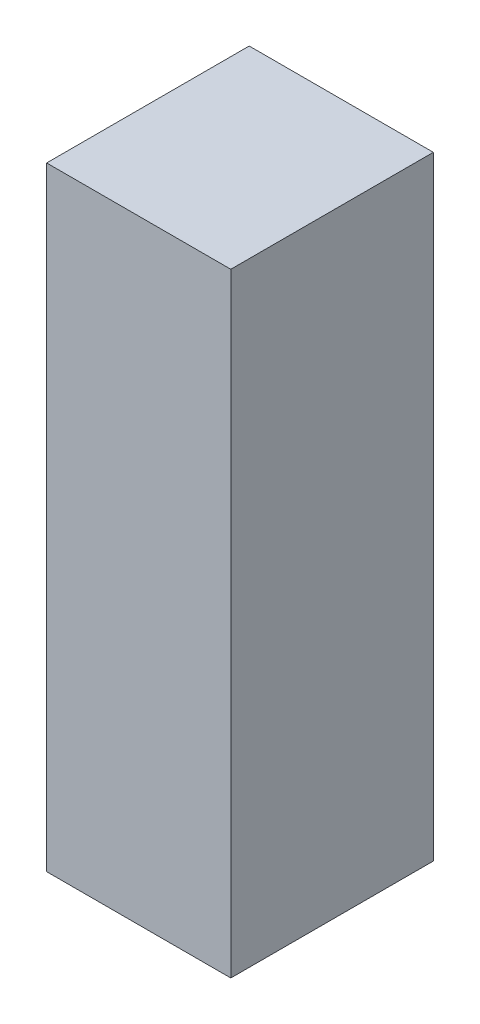
ISO-10303-21;
HEADER;
FILE_DESCRIPTION(('STEP AP214'),'2;1');
FILE_NAME('part.step','',(''),(''),'','','');
FILE_SCHEMA(('AUTOMOTIVE_DESIGN { 1 0 10303 214 1 1 1 1 }'));
ENDSEC;
DATA;
#1=APPLICATION_CONTEXT('core data for automotive mechanical design processes');
#2=APPLICATION_PROTOCOL_DEFINITION('international standard','automotive_design',2000,#1);
#3=PRODUCT_CONTEXT('',#1,'mechanical');
#4=PRODUCT('Part','Part','',(#3));
#5=PRODUCT_RELATED_PRODUCT_CATEGORY('part','',(#4));
#6=PRODUCT_DEFINITION_FORMATION('','',#4);
#7=PRODUCT_DEFINITION_CONTEXT('part definition',#1,'design');
#8=PRODUCT_DEFINITION('design','',#6,#7);
#9=PRODUCT_DEFINITION_SHAPE('','',#8);
#10=(LENGTH_UNIT() NAMED_UNIT(*) SI_UNIT(.MILLI.,.METRE.));
#11=(NAMED_UNIT(*) PLANE_ANGLE_UNIT() SI_UNIT($,.RADIAN.));
#12=(NAMED_UNIT(*) SI_UNIT($,.STERADIAN.) SOLID_ANGLE_UNIT());
#13=UNCERTAINTY_MEASURE_WITH_UNIT(LENGTH_MEASURE(1.E-05),#10,'distance_accuracy_value','');
#14=(GEOMETRIC_REPRESENTATION_CONTEXT(3) GLOBAL_UNCERTAINTY_ASSIGNED_CONTEXT((#13)) GLOBAL_UNIT_ASSIGNED_CONTEXT((#10,
#11,#12)) REPRESENTATION_CONTEXT('',''));
#15=CARTESIAN_POINT('',(0.,0.,0.));
#16=DIRECTION('',(0.,0.,1.));
#17=DIRECTION('',(1.,0.,0.));
#18=AXIS2_PLACEMENT_3D('',#15,#16,#17);
#19=CARTESIAN_POINT('',(0.,0.,660.));
#20=DIRECTION('',(1.,0.,0.));
#21=DIRECTION('',(0.,0.,-1.));
#22=AXIS2_PLACEMENT_3D('',#19,#20,#21);
#23=PLANE('',#22);
#24=DIRECTION('',(0.,-1.,0.));
#25=VECTOR('',#24,1.);
#26=CARTESIAN_POINT('',(0.,0.,0.));
#27=LINE('',#26,#25);
#28=CARTESIAN_POINT('',(0.,2000.,0.));
#29=VERTEX_POINT('',#28);
#30=CARTESIAN_POINT('',(0.,0.,0.));
#31=VERTEX_POINT('',#30);
#32=EDGE_CURVE('E132',#29,#31,#27,.T.);
#33=ORIENTED_EDGE('',*,*,#32,.T.);
#34=DIRECTION('',(0.,0.,-1.));
#35=VECTOR('',#34,1.);
#36=CARTESIAN_POINT('',(0.,0.,660.));
#37=LINE('',#36,#35);
#38=CARTESIAN_POINT('',(0.,0.,660.));
#39=VERTEX_POINT('',#38);
#40=EDGE_CURVE('E11',#39,#31,#37,.T.);
#41=ORIENTED_EDGE('',*,*,#40,.F.);
#42=DIRECTION('',(0.,-1.,0.));
#43=VECTOR('',#42,1.);
#44=CARTESIAN_POINT('',(0.,0.,660.));
#45=LINE('',#44,#43);
#46=CARTESIAN_POINT('',(0.,2000.,660.));
#47=VERTEX_POINT('',#46);
#48=EDGE_CURVE('E142',#47,#39,#45,.T.);
#49=ORIENTED_EDGE('',*,*,#48,.F.);
#50=DIRECTION('',(0.,0.,-1.));
#51=VECTOR('',#50,1.);
#52=CARTESIAN_POINT('',(0.,2000.,660.));
#53=LINE('',#52,#51);
#54=EDGE_CURVE('E147',#47,#29,#53,.T.);
#55=ORIENTED_EDGE('',*,*,#54,.T.);
#56=EDGE_LOOP('',(#33,#41,#49,#55));
#57=FACE_BOUND('',#56,.T.);
#58=ADVANCED_FACE('F34',(#57),#23,.F.);
#59=CARTESIAN_POINT('',(0.,0.,660.));
#60=DIRECTION('',(0.,1.,0.));
#61=DIRECTION('',(0.,0.,1.));
#62=AXIS2_PLACEMENT_3D('',#59,#60,#61);
#63=PLANE('',#62);
#64=DIRECTION('',(1.,0.,0.));
#65=VECTOR('',#64,1.);
#66=CARTESIAN_POINT('',(0.,0.,0.));
#67=LINE('',#66,#65);
#68=CARTESIAN_POINT('',(600.,0.,0.));
#69=VERTEX_POINT('',#68);
#70=EDGE_CURVE('E136',#31,#69,#67,.T.);
#71=ORIENTED_EDGE('',*,*,#70,.T.);
#72=DIRECTION('',(0.,0.,-1.));
#73=VECTOR('',#72,1.);
#74=CARTESIAN_POINT('',(600.,0.,660.));
#75=LINE('',#74,#73);
#76=CARTESIAN_POINT('',(600.,0.,660.));
#77=VERTEX_POINT('',#76);
#78=EDGE_CURVE('E42',#77,#69,#75,.T.);
#79=ORIENTED_EDGE('',*,*,#78,.F.);
#80=DIRECTION('',(1.,0.,0.));
#81=VECTOR('',#80,1.);
#82=CARTESIAN_POINT('',(0.,0.,660.));
#83=LINE('',#82,#81);
#84=EDGE_CURVE('E81',#39,#77,#83,.T.);
#85=ORIENTED_EDGE('',*,*,#84,.F.);
#86=ORIENTED_EDGE('',*,*,#40,.T.);
#87=EDGE_LOOP('',(#71,#79,#85,#86));
#88=FACE_BOUND('',#87,.T.);
#89=ADVANCED_FACE('F171',(#88),#63,.F.);
#90=CARTESIAN_POINT('',(600.,0.,660.));
#91=DIRECTION('',(-1.,0.,0.));
#92=DIRECTION('',(0.,0.,1.));
#93=AXIS2_PLACEMENT_3D('',#90,#91,#92);
#94=PLANE('',#93);
#95=DIRECTION('',(0.,1.,0.));
#96=VECTOR('',#95,1.);
#97=CARTESIAN_POINT('',(600.,0.,0.));
#98=LINE('',#97,#96);
#99=CARTESIAN_POINT('',(600.,2000.,0.));
#100=VERTEX_POINT('',#99);
#101=EDGE_CURVE('E68',#69,#100,#98,.T.);
#102=ORIENTED_EDGE('',*,*,#101,.T.);
#103=DIRECTION('',(0.,0.,-1.));
#104=VECTOR('',#103,1.);
#105=CARTESIAN_POINT('',(600.,2000.,660.));
#106=LINE('',#105,#104);
#107=CARTESIAN_POINT('',(600.,2000.,660.));
#108=VERTEX_POINT('',#107);
#109=EDGE_CURVE('E153',#108,#100,#106,.T.);
#110=ORIENTED_EDGE('',*,*,#109,.F.);
#111=DIRECTION('',(0.,1.,0.));
#112=VECTOR('',#111,1.);
#113=CARTESIAN_POINT('',(600.,0.,660.));
#114=LINE('',#113,#112);
#115=EDGE_CURVE('E145',#77,#108,#114,.T.);
#116=ORIENTED_EDGE('',*,*,#115,.F.);
#117=ORIENTED_EDGE('',*,*,#78,.T.);
#118=EDGE_LOOP('',(#102,#110,#116,#117));
#119=FACE_BOUND('',#118,.T.);
#120=ADVANCED_FACE('F155',(#119),#94,.F.);
#121=CARTESIAN_POINT('',(0.,2000.,660.));
#122=DIRECTION('',(0.,-1.,0.));
#123=DIRECTION('',(0.,0.,-1.));
#124=AXIS2_PLACEMENT_3D('',#121,#122,#123);
#125=PLANE('',#124);
#126=DIRECTION('',(-1.,0.,0.));
#127=VECTOR('',#126,1.);
#128=CARTESIAN_POINT('',(0.,2000.,0.));
#129=LINE('',#128,#127);
#130=EDGE_CURVE('E74',#100,#29,#129,.T.);
#131=ORIENTED_EDGE('',*,*,#130,.T.);
#132=ORIENTED_EDGE('',*,*,#54,.F.);
#133=DIRECTION('',(-1.,0.,0.));
#134=VECTOR('',#133,1.);
#135=CARTESIAN_POINT('',(0.,2000.,660.));
#136=LINE('',#135,#134);
#137=EDGE_CURVE('E50',#108,#47,#136,.T.);
#138=ORIENTED_EDGE('',*,*,#137,.F.);
#139=ORIENTED_EDGE('',*,*,#109,.T.);
#140=EDGE_LOOP('',(#131,#132,#138,#139));
#141=FACE_BOUND('',#140,.T.);
#142=ADVANCED_FACE('F162',(#141),#125,.F.);
#143=CARTESIAN_POINT('',(0.,0.,660.));
#144=DIRECTION('',(0.,0.,1.));
#145=DIRECTION('',(1.,0.,0.));
#146=AXIS2_PLACEMENT_3D('',#143,#144,#145);
#147=PLANE('',#146);
#148=ORIENTED_EDGE('',*,*,#48,.T.);
#149=ORIENTED_EDGE('',*,*,#84,.T.);
#150=ORIENTED_EDGE('',*,*,#115,.T.);
#151=ORIENTED_EDGE('',*,*,#137,.T.);
#152=EDGE_LOOP('',(#148,#149,#150,#151));
#153=FACE_BOUND('',#152,.T.);
#154=ADVANCED_FACE('F164',(#153),#147,.T.);
#155=CARTESIAN_POINT('',(0.,0.,0.));
#156=DIRECTION('',(0.,0.,1.));
#157=DIRECTION('',(1.,0.,0.));
#158=AXIS2_PLACEMENT_3D('',#155,#156,#157);
#159=PLANE('',#158);
#160=ORIENTED_EDGE('',*,*,#32,.F.);
#161=ORIENTED_EDGE('',*,*,#130,.F.);
#162=ORIENTED_EDGE('',*,*,#101,.F.);
#163=ORIENTED_EDGE('',*,*,#70,.F.);
#164=EDGE_LOOP('',(#160,#161,#162,#163));
#165=FACE_BOUND('',#164,.T.);
#166=ADVANCED_FACE('F158',(#165),#159,.F.);
#167=CLOSED_SHELL('',(#58,#89,#120,#142,#154,#166));
#168=CARTESIAN_POINT('',(20.,0.,640.));
#169=DIRECTION('',(1.,0.,0.));
#170=DIRECTION('',(0.,0.,-1.));
#171=AXIS2_PLACEMENT_3D('',#168,#169,#170);
#172=PLANE('',#171);
#173=DIRECTION('',(0.,-1.,0.));
#174=VECTOR('',#173,1.);
#175=CARTESIAN_POINT('',(20.,0.,20.));
#176=LINE('',#175,#174);
#177=CARTESIAN_POINT('',(20.,1980.,20.));
#178=VERTEX_POINT('',#177);
#179=CARTESIAN_POINT('',(20.,20.,20.));
#180=VERTEX_POINT('',#179);
#181=EDGE_CURVE('E261',#178,#180,#176,.T.);
#182=ORIENTED_EDGE('',*,*,#181,.F.);
#183=DIRECTION('',(0.,0.,-1.));
#184=VECTOR('',#183,1.);
#185=CARTESIAN_POINT('',(20.,1980.,640.));
#186=LINE('',#185,#184);
#187=CARTESIAN_POINT('',(20.,1980.,640.));
#188=VERTEX_POINT('',#187);
#189=EDGE_CURVE('E127',#188,#178,#186,.T.);
#190=ORIENTED_EDGE('',*,*,#189,.F.);
#191=DIRECTION('',(0.,-1.,0.));
#192=VECTOR('',#191,1.);
#193=CARTESIAN_POINT('',(20.,0.,640.));
#194=LINE('',#193,#192);
#195=CARTESIAN_POINT('',(20.,20.,640.));
#196=VERTEX_POINT('',#195);
#197=EDGE_CURVE('E112',#188,#196,#194,.T.);
#198=ORIENTED_EDGE('',*,*,#197,.T.);
#199=DIRECTION('',(0.,0.,-1.));
#200=VECTOR('',#199,1.);
#201=CARTESIAN_POINT('',(20.,20.,640.));
#202=LINE('',#201,#200);
#203=EDGE_CURVE('E124',#196,#180,#202,.T.);
#204=ORIENTED_EDGE('',*,*,#203,.T.);
#205=EDGE_LOOP('',(#182,#190,#198,#204));
#206=FACE_BOUND('',#205,.T.);
#207=ADVANCED_FACE('F123',(#206),#172,.T.);
#208=CARTESIAN_POINT('',(0.,20.,640.));
#209=DIRECTION('',(0.,1.,0.));
#210=DIRECTION('',(0.,0.,1.));
#211=AXIS2_PLACEMENT_3D('',#208,#209,#210);
#212=PLANE('',#211);
#213=DIRECTION('',(1.,0.,0.));
#214=VECTOR('',#213,1.);
#215=CARTESIAN_POINT('',(0.,20.,20.));
#216=LINE('',#215,#214);
#217=CARTESIAN_POINT('',(580.,20.,20.));
#218=VERTEX_POINT('',#217);
#219=EDGE_CURVE('E131',#180,#218,#216,.T.);
#220=ORIENTED_EDGE('',*,*,#219,.F.);
#221=ORIENTED_EDGE('',*,*,#203,.F.);
#222=DIRECTION('',(1.,0.,0.));
#223=VECTOR('',#222,1.);
#224=CARTESIAN_POINT('',(0.,20.,640.));
#225=LINE('',#224,#223);
#226=CARTESIAN_POINT('',(580.,20.,640.));
#227=VERTEX_POINT('',#226);
#228=EDGE_CURVE('E108',#196,#227,#225,.T.);
#229=ORIENTED_EDGE('',*,*,#228,.T.);
#230=DIRECTION('',(0.,0.,-1.));
#231=VECTOR('',#230,1.);
#232=CARTESIAN_POINT('',(580.,20.,640.));
#233=LINE('',#232,#231);
#234=EDGE_CURVE('E133',#227,#218,#233,.T.);
#235=ORIENTED_EDGE('',*,*,#234,.T.);
#236=EDGE_LOOP('',(#220,#221,#229,#235));
#237=FACE_BOUND('',#236,.T.);
#238=ADVANCED_FACE('F130',(#237),#212,.T.);
#239=CARTESIAN_POINT('',(580.,0.,640.));
#240=DIRECTION('',(-1.,0.,0.));
#241=DIRECTION('',(0.,0.,1.));
#242=AXIS2_PLACEMENT_3D('',#239,#240,#241);
#243=PLANE('',#242);
#244=DIRECTION('',(0.,1.,0.));
#245=VECTOR('',#244,1.);
#246=CARTESIAN_POINT('',(580.,0.,20.));
#247=LINE('',#246,#245);
#248=CARTESIAN_POINT('',(580.,1980.,20.));
#249=VERTEX_POINT('',#248);
#250=EDGE_CURVE('E264',#218,#249,#247,.T.);
#251=ORIENTED_EDGE('',*,*,#250,.F.);
#252=ORIENTED_EDGE('',*,*,#234,.F.);
#253=DIRECTION('',(0.,1.,0.));
#254=VECTOR('',#253,1.);
#255=CARTESIAN_POINT('',(580.,0.,640.));
#256=LINE('',#255,#254);
#257=CARTESIAN_POINT('',(580.,1980.,640.));
#258=VERTEX_POINT('',#257);
#259=EDGE_CURVE('E113',#227,#258,#256,.T.);
#260=ORIENTED_EDGE('',*,*,#259,.T.);
#261=DIRECTION('',(0.,0.,-1.));
#262=VECTOR('',#261,1.);
#263=CARTESIAN_POINT('',(580.,1980.,640.));
#264=LINE('',#263,#262);
#265=EDGE_CURVE('E138',#258,#249,#264,.T.);
#266=ORIENTED_EDGE('',*,*,#265,.T.);
#267=EDGE_LOOP('',(#251,#252,#260,#266));
#268=FACE_BOUND('',#267,.T.);
#269=ADVANCED_FACE('F219',(#268),#243,.T.);
#270=CARTESIAN_POINT('',(0.,1980.,640.));
#271=DIRECTION('',(0.,-1.,0.));
#272=DIRECTION('',(0.,0.,-1.));
#273=AXIS2_PLACEMENT_3D('',#270,#271,#272);
#274=PLANE('',#273);
#275=DIRECTION('',(-1.,0.,0.));
#276=VECTOR('',#275,1.);
#277=CARTESIAN_POINT('',(0.,1980.,20.));
#278=LINE('',#277,#276);
#279=EDGE_CURVE('E128',#249,#178,#278,.T.);
#280=ORIENTED_EDGE('',*,*,#279,.F.);
#281=ORIENTED_EDGE('',*,*,#265,.F.);
#282=DIRECTION('',(-1.,0.,0.));
#283=VECTOR('',#282,1.);
#284=CARTESIAN_POINT('',(0.,1980.,640.));
#285=LINE('',#284,#283);
#286=EDGE_CURVE('E267',#258,#188,#285,.T.);
#287=ORIENTED_EDGE('',*,*,#286,.T.);
#288=ORIENTED_EDGE('',*,*,#189,.T.);
#289=EDGE_LOOP('',(#280,#281,#287,#288));
#290=FACE_BOUND('',#289,.T.);
#291=ADVANCED_FACE('F228',(#290),#274,.T.);
#292=CARTESIAN_POINT('',(0.,0.,640.));
#293=DIRECTION('',(0.,0.,1.));
#294=DIRECTION('',(1.,0.,0.));
#295=AXIS2_PLACEMENT_3D('',#292,#293,#294);
#296=PLANE('',#295);
#297=ORIENTED_EDGE('',*,*,#197,.F.);
#298=ORIENTED_EDGE('',*,*,#286,.F.);
#299=ORIENTED_EDGE('',*,*,#259,.F.);
#300=ORIENTED_EDGE('',*,*,#228,.F.);
#301=EDGE_LOOP('',(#297,#298,#299,#300));
#302=FACE_BOUND('',#301,.T.);
#303=ADVANCED_FACE('F110',(#302),#296,.F.);
#304=CARTESIAN_POINT('',(0.,0.,20.));
#305=DIRECTION('',(0.,0.,1.));
#306=DIRECTION('',(1.,0.,0.));
#307=AXIS2_PLACEMENT_3D('',#304,#305,#306);
#308=PLANE('',#307);
#309=ORIENTED_EDGE('',*,*,#181,.T.);
#310=ORIENTED_EDGE('',*,*,#219,.T.);
#311=ORIENTED_EDGE('',*,*,#250,.T.);
#312=ORIENTED_EDGE('',*,*,#279,.T.);
#313=EDGE_LOOP('',(#309,#310,#311,#312));
#314=FACE_BOUND('',#313,.T.);
#315=ADVANCED_FACE('F247',(#314),#308,.T.);
#316=CLOSED_SHELL('',(#207,#238,#269,#291,#303,#315));
#317=ORIENTED_CLOSED_SHELL('',*,#316,.T.);
#318=BREP_WITH_VOIDS('B2',#167,(#317));
#319=ADVANCED_BREP_SHAPE_REPRESENTATION('',(#18,#318),#14);
#320=SHAPE_DEFINITION_REPRESENTATION(#9,#319);
ENDSEC;
END-ISO-10303-21;
